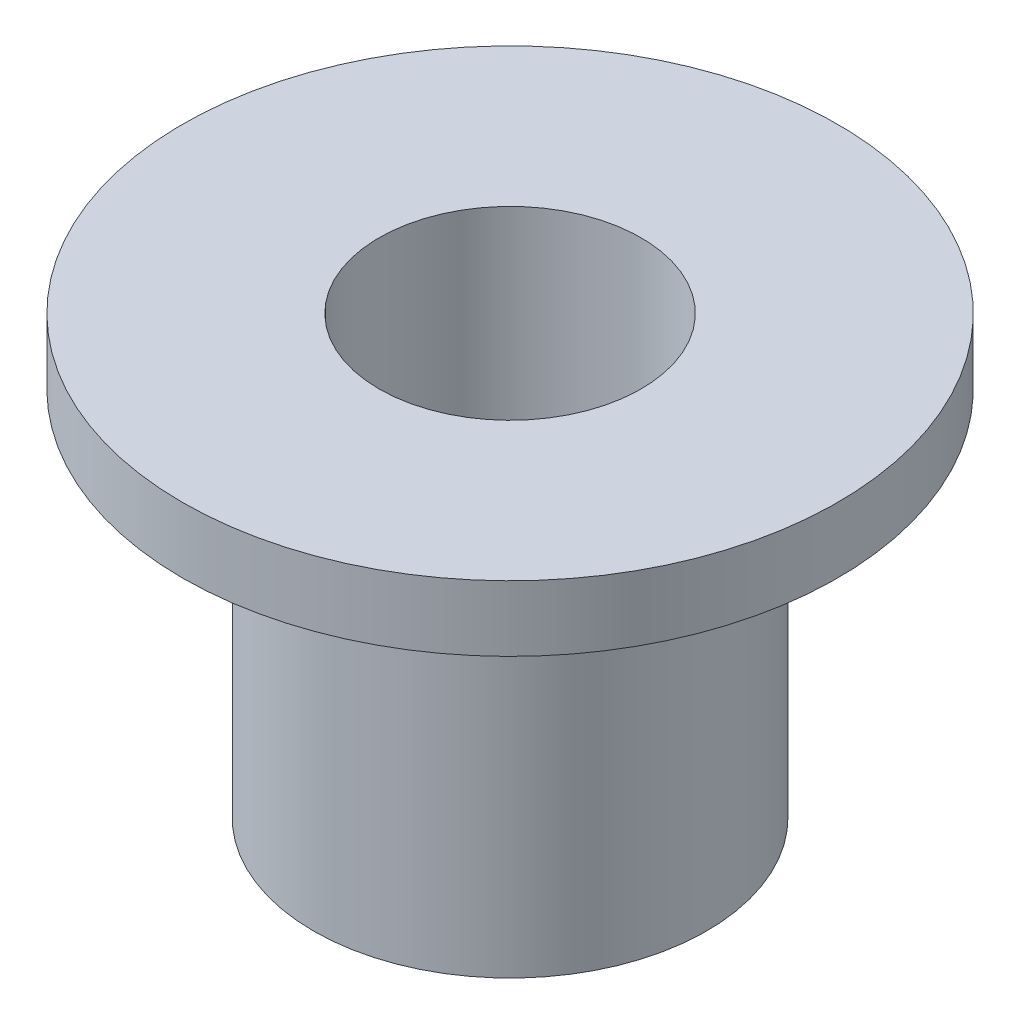
ISO-10303-21;
HEADER;
FILE_DESCRIPTION(('STEP AP214'),'2;1');
FILE_NAME('part.step','',(''),(''),'','','');
FILE_SCHEMA(('AUTOMOTIVE_DESIGN { 1 0 10303 214 1 1 1 1 }'));
ENDSEC;
DATA;
#1=APPLICATION_CONTEXT('core data for automotive mechanical design processes');
#2=APPLICATION_PROTOCOL_DEFINITION('international standard','automotive_design',2000,#1);
#3=PRODUCT_CONTEXT('',#1,'mechanical');
#4=PRODUCT('Part','Part','',(#3));
#5=PRODUCT_RELATED_PRODUCT_CATEGORY('part','',(#4));
#6=PRODUCT_DEFINITION_FORMATION('','',#4);
#7=PRODUCT_DEFINITION_CONTEXT('part definition',#1,'design');
#8=PRODUCT_DEFINITION('design','',#6,#7);
#9=PRODUCT_DEFINITION_SHAPE('','',#8);
#10=(LENGTH_UNIT() NAMED_UNIT(*) SI_UNIT(.MILLI.,.METRE.));
#11=(NAMED_UNIT(*) PLANE_ANGLE_UNIT() SI_UNIT($,.RADIAN.));
#12=(NAMED_UNIT(*) SI_UNIT($,.STERADIAN.) SOLID_ANGLE_UNIT());
#13=UNCERTAINTY_MEASURE_WITH_UNIT(LENGTH_MEASURE(1.E-05),#10,'distance_accuracy_value','');
#14=(GEOMETRIC_REPRESENTATION_CONTEXT(3) GLOBAL_UNCERTAINTY_ASSIGNED_CONTEXT((#13)) GLOBAL_UNIT_ASSIGNED_CONTEXT((#10,
#11,#12)) REPRESENTATION_CONTEXT('',''));
#15=CARTESIAN_POINT('',(0.,0.,0.));
#16=DIRECTION('',(0.,0.,1.));
#17=DIRECTION('',(1.,0.,0.));
#18=AXIS2_PLACEMENT_3D('',#15,#16,#17);
#19=CARTESIAN_POINT('',(0.,5.,0.));
#20=DIRECTION('',(0.,1.,0.));
#21=DIRECTION('',(0.,0.,1.));
#22=AXIS2_PLACEMENT_3D('',#19,#20,#21);
#23=CYLINDRICAL_SURFACE('',#22,3.75);
#24=CARTESIAN_POINT('',(0.,4.25,0.));
#25=DIRECTION('',(0.,1.,0.));
#26=DIRECTION('',(0.,0.,1.));
#27=AXIS2_PLACEMENT_3D('',#24,#25,#26);
#28=CIRCLE('',#27,3.75);
#29=CARTESIAN_POINT('',(0.,4.25,3.75));
#30=VERTEX_POINT('',#29);
#31=EDGE_CURVE('E51',#30,#30,#28,.T.);
#32=ORIENTED_EDGE('',*,*,#31,.T.);
#33=EDGE_LOOP('',(#32));
#34=FACE_BOUND('',#33,.T.);
#35=CARTESIAN_POINT('',(0.,5.,0.));
#36=DIRECTION('',(0.,1.,0.));
#37=DIRECTION('',(0.,0.,1.));
#38=AXIS2_PLACEMENT_3D('',#35,#36,#37);
#39=CIRCLE('',#38,3.75);
#40=CARTESIAN_POINT('',(0.,5.,3.75));
#41=VERTEX_POINT('',#40);
#42=EDGE_CURVE('E10',#41,#41,#39,.T.);
#43=ORIENTED_EDGE('',*,*,#42,.F.);
#44=EDGE_LOOP('',(#43));
#45=FACE_BOUND('',#44,.T.);
#46=ADVANCED_FACE('F29',(#34,#45),#23,.T.);
#47=CARTESIAN_POINT('',(-3.75,5.,0.));
#48=DIRECTION('',(0.,1.,0.));
#49=DIRECTION('',(0.,0.,1.));
#50=AXIS2_PLACEMENT_3D('',#47,#48,#49);
#51=PLANE('',#50);
#52=ORIENTED_EDGE('',*,*,#42,.T.);
#53=EDGE_LOOP('',(#52));
#54=FACE_BOUND('',#53,.T.);
#55=CARTESIAN_POINT('',(0.,5.,0.));
#56=DIRECTION('',(0.,1.,0.));
#57=DIRECTION('',(0.,0.,1.));
#58=AXIS2_PLACEMENT_3D('',#55,#56,#57);
#59=CIRCLE('',#58,1.5);
#60=CARTESIAN_POINT('',(0.,5.,1.5));
#61=VERTEX_POINT('',#60);
#62=EDGE_CURVE('E35',#61,#61,#59,.T.);
#63=ORIENTED_EDGE('',*,*,#62,.F.);
#64=EDGE_LOOP('',(#63));
#65=FACE_BOUND('',#64,.T.);
#66=ADVANCED_FACE('F69',(#54,#65),#51,.T.);
#67=CARTESIAN_POINT('',(0.,5.,0.));
#68=DIRECTION('',(0.,1.,0.));
#69=DIRECTION('',(0.,0.,1.));
#70=AXIS2_PLACEMENT_3D('',#67,#68,#69);
#71=CYLINDRICAL_SURFACE('',#70,1.5);
#72=ORIENTED_EDGE('',*,*,#62,.T.);
#73=EDGE_LOOP('',(#72));
#74=FACE_BOUND('',#73,.T.);
#75=CARTESIAN_POINT('',(0.,0.,0.));
#76=DIRECTION('',(0.,1.,0.));
#77=DIRECTION('',(0.,0.,1.));
#78=AXIS2_PLACEMENT_3D('',#75,#76,#77);
#79=CIRCLE('',#78,1.5);
#80=CARTESIAN_POINT('',(0.,0.,1.5));
#81=VERTEX_POINT('',#80);
#82=EDGE_CURVE('E39',#81,#81,#79,.T.);
#83=ORIENTED_EDGE('',*,*,#82,.F.);
#84=EDGE_LOOP('',(#83));
#85=FACE_BOUND('',#84,.T.);
#86=ADVANCED_FACE('F73',(#74,#85),#71,.F.);
#87=CARTESIAN_POINT('',(-1.5,0.,0.));
#88=DIRECTION('',(0.,-1.,0.));
#89=DIRECTION('',(0.,0.,-1.));
#90=AXIS2_PLACEMENT_3D('',#87,#88,#89);
#91=PLANE('',#90);
#92=ORIENTED_EDGE('',*,*,#82,.T.);
#93=EDGE_LOOP('',(#92));
#94=FACE_BOUND('',#93,.T.);
#95=CARTESIAN_POINT('',(0.,0.,0.));
#96=DIRECTION('',(0.,1.,0.));
#97=DIRECTION('',(0.,0.,1.));
#98=AXIS2_PLACEMENT_3D('',#95,#96,#97);
#99=CIRCLE('',#98,2.25);
#100=CARTESIAN_POINT('',(0.,0.,2.25));
#101=VERTEX_POINT('',#100);
#102=EDGE_CURVE('E43',#101,#101,#99,.T.);
#103=ORIENTED_EDGE('',*,*,#102,.F.);
#104=EDGE_LOOP('',(#103));
#105=FACE_BOUND('',#104,.T.);
#106=ADVANCED_FACE('F65',(#94,#105),#91,.T.);
#107=CARTESIAN_POINT('',(0.,5.,0.));
#108=DIRECTION('',(0.,1.,0.));
#109=DIRECTION('',(0.,0.,1.));
#110=AXIS2_PLACEMENT_3D('',#107,#108,#109);
#111=CYLINDRICAL_SURFACE('',#110,2.25);
#112=ORIENTED_EDGE('',*,*,#102,.T.);
#113=EDGE_LOOP('',(#112));
#114=FACE_BOUND('',#113,.T.);
#115=CARTESIAN_POINT('',(0.,4.25,0.));
#116=DIRECTION('',(0.,1.,0.));
#117=DIRECTION('',(0.,0.,1.));
#118=AXIS2_PLACEMENT_3D('',#115,#116,#117);
#119=CIRCLE('',#118,2.25);
#120=CARTESIAN_POINT('',(0.,4.25,2.25));
#121=VERTEX_POINT('',#120);
#122=EDGE_CURVE('E48',#121,#121,#119,.T.);
#123=ORIENTED_EDGE('',*,*,#122,.F.);
#124=EDGE_LOOP('',(#123));
#125=FACE_BOUND('',#124,.T.);
#126=ADVANCED_FACE('F59',(#114,#125),#111,.T.);
#127=CARTESIAN_POINT('',(-2.25,4.25,0.));
#128=DIRECTION('',(0.,-1.,0.));
#129=DIRECTION('',(0.,0.,-1.));
#130=AXIS2_PLACEMENT_3D('',#127,#128,#129);
#131=PLANE('',#130);
#132=ORIENTED_EDGE('',*,*,#122,.T.);
#133=EDGE_LOOP('',(#132));
#134=FACE_BOUND('',#133,.T.);
#135=ORIENTED_EDGE('',*,*,#31,.F.);
#136=EDGE_LOOP('',(#135));
#137=FACE_BOUND('',#136,.T.);
#138=ADVANCED_FACE('F57',(#134,#137),#131,.T.);
#139=CLOSED_SHELL('',(#46,#66,#86,#106,#126,#138));
#140=MANIFOLD_SOLID_BREP('B2',#139);
#141=ADVANCED_BREP_SHAPE_REPRESENTATION('',(#18,#140),#14);
#142=SHAPE_DEFINITION_REPRESENTATION(#9,#141);
ENDSEC;
END-ISO-10303-21;
